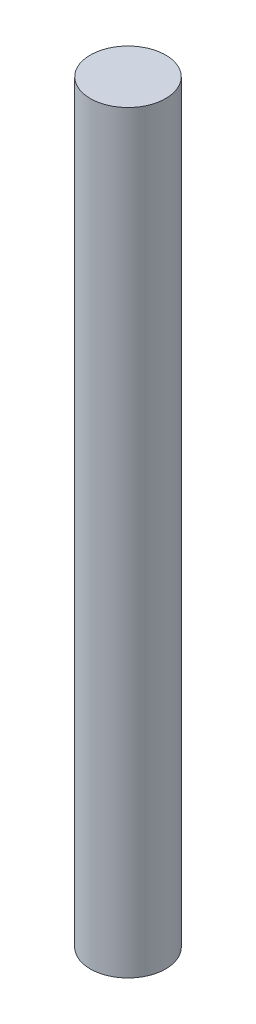
ISO-10303-21;
HEADER;
FILE_DESCRIPTION(('STEP AP214'),'2;1');
FILE_NAME('part.step','',(''),(''),'','','');
FILE_SCHEMA(('AUTOMOTIVE_DESIGN { 1 0 10303 214 1 1 1 1 }'));
ENDSEC;
DATA;
#1=APPLICATION_CONTEXT('core data for automotive mechanical design processes');
#2=APPLICATION_PROTOCOL_DEFINITION('international standard','automotive_design',2000,#1);
#3=PRODUCT_CONTEXT('',#1,'mechanical');
#4=PRODUCT('Part','Part','',(#3));
#5=PRODUCT_RELATED_PRODUCT_CATEGORY('part','',(#4));
#6=PRODUCT_DEFINITION_FORMATION('','',#4);
#7=PRODUCT_DEFINITION_CONTEXT('part definition',#1,'design');
#8=PRODUCT_DEFINITION('design','',#6,#7);
#9=PRODUCT_DEFINITION_SHAPE('','',#8);
#10=(LENGTH_UNIT() NAMED_UNIT(*) SI_UNIT(.MILLI.,.METRE.));
#11=(NAMED_UNIT(*) PLANE_ANGLE_UNIT() SI_UNIT($,.RADIAN.));
#12=(NAMED_UNIT(*) SI_UNIT($,.STERADIAN.) SOLID_ANGLE_UNIT());
#13=UNCERTAINTY_MEASURE_WITH_UNIT(LENGTH_MEASURE(1.E-05),#10,'distance_accuracy_value','');
#14=(GEOMETRIC_REPRESENTATION_CONTEXT(3) GLOBAL_UNCERTAINTY_ASSIGNED_CONTEXT((#13)) GLOBAL_UNIT_ASSIGNED_CONTEXT((#10,
#11,#12)) REPRESENTATION_CONTEXT('',''));
#15=CARTESIAN_POINT('',(0.,0.,0.));
#16=DIRECTION('',(0.,0.,1.));
#17=DIRECTION('',(1.,0.,0.));
#18=AXIS2_PLACEMENT_3D('',#15,#16,#17);
#19=CARTESIAN_POINT('',(0.,2.54,0.));
#20=DIRECTION('',(0.,-1.,0.));
#21=DIRECTION('',(0.,0.,-1.));
#22=AXIS2_PLACEMENT_3D('',#19,#20,#21);
#23=CYLINDRICAL_SURFACE('',#22,0.127);
#24=CARTESIAN_POINT('',(0.,2.54,0.));
#25=DIRECTION('',(0.,1.,0.));
#26=DIRECTION('',(0.,0.,1.));
#27=AXIS2_PLACEMENT_3D('',#24,#25,#26);
#28=CIRCLE('',#27,0.127);
#29=CARTESIAN_POINT('',(0.,2.54,0.127));
#30=VERTEX_POINT('',#29);
#31=EDGE_CURVE('E10',#30,#30,#28,.T.);
#32=ORIENTED_EDGE('',*,*,#31,.F.);
#33=EDGE_LOOP('',(#32));
#34=FACE_BOUND('',#33,.T.);
#35=CARTESIAN_POINT('',(0.,0.,0.));
#36=DIRECTION('',(0.,1.,0.));
#37=DIRECTION('',(0.,0.,1.));
#38=AXIS2_PLACEMENT_3D('',#35,#36,#37);
#39=CIRCLE('',#38,0.127);
#40=CARTESIAN_POINT('',(0.,0.,0.127));
#41=VERTEX_POINT('',#40);
#42=EDGE_CURVE('E42',#41,#41,#39,.T.);
#43=ORIENTED_EDGE('',*,*,#42,.T.);
#44=EDGE_LOOP('',(#43));
#45=FACE_BOUND('',#44,.T.);
#46=ADVANCED_FACE('F39',(#34,#45),#23,.T.);
#47=CARTESIAN_POINT('',(0.,2.54,0.));
#48=DIRECTION('',(0.,1.,0.));
#49=DIRECTION('',(0.,0.,1.));
#50=AXIS2_PLACEMENT_3D('',#47,#48,#49);
#51=PLANE('',#50);
#52=ORIENTED_EDGE('',*,*,#31,.T.);
#53=EDGE_LOOP('',(#52));
#54=FACE_BOUND('',#53,.T.);
#55=ADVANCED_FACE('F56',(#54),#51,.T.);
#56=CARTESIAN_POINT('',(0.,0.,0.));
#57=DIRECTION('',(0.,1.,0.));
#58=DIRECTION('',(0.,0.,1.));
#59=AXIS2_PLACEMENT_3D('',#56,#57,#58);
#60=PLANE('',#59);
#61=ORIENTED_EDGE('',*,*,#42,.F.);
#62=EDGE_LOOP('',(#61));
#63=FACE_BOUND('',#62,.T.);
#64=ADVANCED_FACE('F54',(#63),#60,.F.);
#65=CLOSED_SHELL('',(#46,#55,#64));
#66=MANIFOLD_SOLID_BREP('B2',#65);
#67=ADVANCED_BREP_SHAPE_REPRESENTATION('',(#18,#66),#14);
#68=SHAPE_DEFINITION_REPRESENTATION(#9,#67);
ENDSEC;
END-ISO-10303-21;
